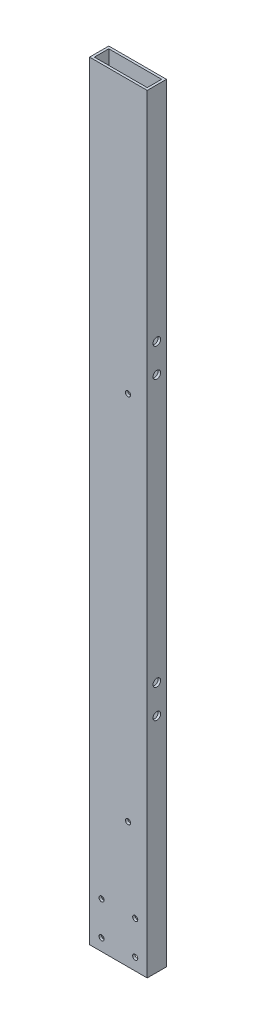
ISO-10303-21;
HEADER;
FILE_DESCRIPTION(('STEP AP214'),'2;1');
FILE_NAME('part.step','',(''),(''),'','','');
FILE_SCHEMA(('AUTOMOTIVE_DESIGN { 1 0 10303 214 1 1 1 1 }'));
ENDSEC;
DATA;
#1=APPLICATION_CONTEXT('core data for automotive mechanical design processes');
#2=APPLICATION_PROTOCOL_DEFINITION('international standard','automotive_design',2000,#1);
#3=PRODUCT_CONTEXT('',#1,'mechanical');
#4=PRODUCT('Part','Part','',(#3));
#5=PRODUCT_RELATED_PRODUCT_CATEGORY('part','',(#4));
#6=PRODUCT_DEFINITION_FORMATION('','',#4);
#7=PRODUCT_DEFINITION_CONTEXT('part definition',#1,'design');
#8=PRODUCT_DEFINITION('design','',#6,#7);
#9=PRODUCT_DEFINITION_SHAPE('','',#8);
#10=(LENGTH_UNIT() NAMED_UNIT(*) SI_UNIT(.MILLI.,.METRE.));
#11=(NAMED_UNIT(*) PLANE_ANGLE_UNIT() SI_UNIT($,.RADIAN.));
#12=(NAMED_UNIT(*) SI_UNIT($,.STERADIAN.) SOLID_ANGLE_UNIT());
#13=UNCERTAINTY_MEASURE_WITH_UNIT(LENGTH_MEASURE(1.E-05),#10,'distance_accuracy_value','');
#14=(GEOMETRIC_REPRESENTATION_CONTEXT(3) GLOBAL_UNCERTAINTY_ASSIGNED_CONTEXT((#13)) GLOBAL_UNIT_ASSIGNED_CONTEXT((#10,
#11,#12)) REPRESENTATION_CONTEXT('',''));
#15=CARTESIAN_POINT('',(0.,0.,0.));
#16=DIRECTION('',(0.,0.,1.));
#17=DIRECTION('',(1.,0.,0.));
#18=AXIS2_PLACEMENT_3D('',#15,#16,#17);
#19=CARTESIAN_POINT('',(0.,1016.,0.));
#20=DIRECTION('',(0.,-1.,0.));
#21=DIRECTION('',(0.,0.,-1.));
#22=AXIS2_PLACEMENT_3D('',#19,#20,#21);
#23=PLANE('',#22);
#24=DIRECTION('',(0.,0.,1.));
#25=VECTOR('',#24,1.);
#26=CARTESIAN_POINT('',(0.,1016.,0.));
#27=LINE('',#26,#25);
#28=CARTESIAN_POINT('',(0.,1016.,-25.4));
#29=VERTEX_POINT('',#28);
#30=CARTESIAN_POINT('',(0.,1016.,0.));
#31=VERTEX_POINT('',#30);
#32=EDGE_CURVE('E139',#29,#31,#27,.T.);
#33=ORIENTED_EDGE('',*,*,#32,.T.);
#34=DIRECTION('',(1.,0.,0.));
#35=VECTOR('',#34,1.);
#36=CARTESIAN_POINT('',(0.,1016.,0.));
#37=LINE('',#36,#35);
#38=CARTESIAN_POINT('',(76.2,1016.,0.));
#39=VERTEX_POINT('',#38);
#40=EDGE_CURVE('E142',#31,#39,#37,.T.);
#41=ORIENTED_EDGE('',*,*,#40,.T.);
#42=DIRECTION('',(0.,0.,-1.));
#43=VECTOR('',#42,1.);
#44=CARTESIAN_POINT('',(76.2,1016.,0.));
#45=LINE('',#44,#43);
#46=CARTESIAN_POINT('',(76.2,1016.,-25.4));
#47=VERTEX_POINT('',#46);
#48=EDGE_CURVE('E145',#39,#47,#45,.T.);
#49=ORIENTED_EDGE('',*,*,#48,.T.);
#50=DIRECTION('',(-1.,0.,0.));
#51=VECTOR('',#50,1.);
#52=CARTESIAN_POINT('',(0.,1016.,-25.4));
#53=LINE('',#52,#51);
#54=EDGE_CURVE('E147',#47,#29,#53,.T.);
#55=ORIENTED_EDGE('',*,*,#54,.T.);
#56=EDGE_LOOP('',(#33,#41,#49,#55));
#57=FACE_BOUND('',#56,.T.);
#58=DIRECTION('',(0.,0.,1.));
#59=VECTOR('',#58,1.);
#60=CARTESIAN_POINT('',(3.175,1016.,-3.175));
#61=LINE('',#60,#59);
#62=CARTESIAN_POINT('',(3.175,1016.,-22.225));
#63=VERTEX_POINT('',#62);
#64=CARTESIAN_POINT('',(3.175,1016.,-3.175));
#65=VERTEX_POINT('',#64);
#66=EDGE_CURVE('E101',#63,#65,#61,.T.);
#67=ORIENTED_EDGE('',*,*,#66,.F.);
#68=DIRECTION('',(-1.,0.,0.));
#69=VECTOR('',#68,1.);
#70=CARTESIAN_POINT('',(3.175,1016.,-22.225));
#71=LINE('',#70,#69);
#72=CARTESIAN_POINT('',(73.025,1016.,-22.225));
#73=VERTEX_POINT('',#72);
#74=EDGE_CURVE('E123',#73,#63,#71,.T.);
#75=ORIENTED_EDGE('',*,*,#74,.F.);
#76=DIRECTION('',(0.,0.,-1.));
#77=VECTOR('',#76,1.);
#78=CARTESIAN_POINT('',(73.025,1016.,-3.175));
#79=LINE('',#78,#77);
#80=CARTESIAN_POINT('',(73.025,1016.,-3.175));
#81=VERTEX_POINT('',#80);
#82=EDGE_CURVE('E121',#81,#73,#79,.T.);
#83=ORIENTED_EDGE('',*,*,#82,.F.);
#84=DIRECTION('',(1.,0.,0.));
#85=VECTOR('',#84,1.);
#86=CARTESIAN_POINT('',(3.175,1016.,-3.175));
#87=LINE('',#86,#85);
#88=EDGE_CURVE('E109',#65,#81,#87,.T.);
#89=ORIENTED_EDGE('',*,*,#88,.F.);
#90=EDGE_LOOP('',(#67,#75,#83,#89));
#91=FACE_BOUND('',#90,.T.);
#92=ADVANCED_FACE('F34',(#57,#91),#23,.F.);
#93=CARTESIAN_POINT('',(0.,0.,0.));
#94=DIRECTION('',(0.,-1.,0.));
#95=DIRECTION('',(0.,0.,-1.));
#96=AXIS2_PLACEMENT_3D('',#93,#94,#95);
#97=PLANE('',#96);
#98=DIRECTION('',(0.,0.,1.));
#99=VECTOR('',#98,1.);
#100=CARTESIAN_POINT('',(0.,0.,0.));
#101=LINE('',#100,#99);
#102=CARTESIAN_POINT('',(0.,0.,-25.4));
#103=VERTEX_POINT('',#102);
#104=CARTESIAN_POINT('',(0.,0.,0.));
#105=VERTEX_POINT('',#104);
#106=EDGE_CURVE('E117',#103,#105,#101,.T.);
#107=ORIENTED_EDGE('',*,*,#106,.F.);
#108=DIRECTION('',(-1.,0.,0.));
#109=VECTOR('',#108,1.);
#110=CARTESIAN_POINT('',(0.,0.,-25.4));
#111=LINE('',#110,#109);
#112=CARTESIAN_POINT('',(76.2,0.,-25.4));
#113=VERTEX_POINT('',#112);
#114=EDGE_CURVE('E143',#113,#103,#111,.T.);
#115=ORIENTED_EDGE('',*,*,#114,.F.);
#116=DIRECTION('',(0.,0.,-1.));
#117=VECTOR('',#116,1.);
#118=CARTESIAN_POINT('',(76.2,0.,0.));
#119=LINE('',#118,#117);
#120=CARTESIAN_POINT('',(76.2,0.,0.));
#121=VERTEX_POINT('',#120);
#122=EDGE_CURVE('E154',#121,#113,#119,.T.);
#123=ORIENTED_EDGE('',*,*,#122,.F.);
#124=DIRECTION('',(1.,0.,0.));
#125=VECTOR('',#124,1.);
#126=CARTESIAN_POINT('',(0.,0.,0.));
#127=LINE('',#126,#125);
#128=EDGE_CURVE('E152',#105,#121,#127,.T.);
#129=ORIENTED_EDGE('',*,*,#128,.F.);
#130=EDGE_LOOP('',(#107,#115,#123,#129));
#131=FACE_BOUND('',#130,.T.);
#132=DIRECTION('',(-1.,0.,0.));
#133=VECTOR('',#132,1.);
#134=CARTESIAN_POINT('',(3.175,0.,-22.225));
#135=LINE('',#134,#133);
#136=CARTESIAN_POINT('',(73.025,0.,-22.225));
#137=VERTEX_POINT('',#136);
#138=CARTESIAN_POINT('',(3.175,0.,-22.225));
#139=VERTEX_POINT('',#138);
#140=EDGE_CURVE('E110',#137,#139,#135,.T.);
#141=ORIENTED_EDGE('',*,*,#140,.T.);
#142=DIRECTION('',(0.,0.,1.));
#143=VECTOR('',#142,1.);
#144=CARTESIAN_POINT('',(3.175,0.,-3.175));
#145=LINE('',#144,#143);
#146=CARTESIAN_POINT('',(3.175,0.,-3.175));
#147=VERTEX_POINT('',#146);
#148=EDGE_CURVE('E59',#139,#147,#145,.T.);
#149=ORIENTED_EDGE('',*,*,#148,.T.);
#150=DIRECTION('',(1.,0.,0.));
#151=VECTOR('',#150,1.);
#152=CARTESIAN_POINT('',(3.175,0.,-3.175));
#153=LINE('',#152,#151);
#154=CARTESIAN_POINT('',(73.025,0.,-3.175));
#155=VERTEX_POINT('',#154);
#156=EDGE_CURVE('E116',#147,#155,#153,.T.);
#157=ORIENTED_EDGE('',*,*,#156,.T.);
#158=DIRECTION('',(0.,0.,-1.));
#159=VECTOR('',#158,1.);
#160=CARTESIAN_POINT('',(73.025,0.,-3.175));
#161=LINE('',#160,#159);
#162=EDGE_CURVE('E131',#155,#137,#161,.T.);
#163=ORIENTED_EDGE('',*,*,#162,.T.);
#164=EDGE_LOOP('',(#141,#149,#157,#163));
#165=FACE_BOUND('',#164,.T.);
#166=ADVANCED_FACE('F297',(#131,#165),#97,.T.);
#167=CARTESIAN_POINT('',(0.,1016.,0.));
#168=DIRECTION('',(1.,0.,0.));
#169=DIRECTION('',(0.,0.,-1.));
#170=AXIS2_PLACEMENT_3D('',#167,#168,#169);
#171=PLANE('',#170);
#172=CARTESIAN_POINT('',(0.,684.2125,-12.7));
#173=DIRECTION('',(-1.,0.,0.));
#174=DIRECTION('',(0.,0.,-1.));
#175=AXIS2_PLACEMENT_3D('',#172,#173,#174);
#176=CIRCLE('',#175,5.04189999999999);
#177=CARTESIAN_POINT('',(0.,684.2125,-17.7419));
#178=VERTEX_POINT('',#177);
#179=EDGE_CURVE('E182',#178,#178,#176,.T.);
#180=ORIENTED_EDGE('',*,*,#179,.F.);
#181=EDGE_LOOP('',(#180));
#182=FACE_BOUND('',#181,.T.);
#183=CARTESIAN_POINT('',(0.,722.3125,-12.7));
#184=DIRECTION('',(-1.,0.,0.));
#185=DIRECTION('',(0.,0.,-1.));
#186=AXIS2_PLACEMENT_3D('',#183,#184,#185);
#187=CIRCLE('',#186,5.04189999999999);
#188=CARTESIAN_POINT('',(0.,722.3125,-17.7419));
#189=VERTEX_POINT('',#188);
#190=EDGE_CURVE('E177',#189,#189,#187,.T.);
#191=ORIENTED_EDGE('',*,*,#190,.F.);
#192=EDGE_LOOP('',(#191));
#193=FACE_BOUND('',#192,.T.);
#194=CARTESIAN_POINT('',(0.,331.7875,-12.7));
#195=DIRECTION('',(1.,0.,0.));
#196=DIRECTION('',(0.,0.,-1.));
#197=AXIS2_PLACEMENT_3D('',#194,#195,#196);
#198=CIRCLE('',#197,5.04189999999999);
#199=CARTESIAN_POINT('',(0.,331.7875,-17.7419));
#200=VERTEX_POINT('',#199);
#201=EDGE_CURVE('E172',#200,#200,#198,.T.);
#202=ORIENTED_EDGE('',*,*,#201,.T.);
#203=EDGE_LOOP('',(#202));
#204=FACE_BOUND('',#203,.T.);
#205=CARTESIAN_POINT('',(0.,293.6875,-12.7));
#206=DIRECTION('',(1.,0.,0.));
#207=DIRECTION('',(0.,0.,-1.));
#208=AXIS2_PLACEMENT_3D('',#205,#206,#207);
#209=CIRCLE('',#208,5.04189999999999);
#210=CARTESIAN_POINT('',(0.,293.6875,-17.7419));
#211=VERTEX_POINT('',#210);
#212=EDGE_CURVE('E167',#211,#211,#209,.T.);
#213=ORIENTED_EDGE('',*,*,#212,.T.);
#214=EDGE_LOOP('',(#213));
#215=FACE_BOUND('',#214,.T.);
#216=ORIENTED_EDGE('',*,*,#106,.T.);
#217=DIRECTION('',(0.,-1.,0.));
#218=VECTOR('',#217,1.);
#219=CARTESIAN_POINT('',(0.,1016.,0.));
#220=LINE('',#219,#218);
#221=EDGE_CURVE('E11',#31,#105,#220,.T.);
#222=ORIENTED_EDGE('',*,*,#221,.F.);
#223=ORIENTED_EDGE('',*,*,#32,.F.);
#224=DIRECTION('',(0.,-1.,0.));
#225=VECTOR('',#224,1.);
#226=CARTESIAN_POINT('',(0.,1016.,-25.4));
#227=LINE('',#226,#225);
#228=EDGE_CURVE('E149',#29,#103,#227,.T.);
#229=ORIENTED_EDGE('',*,*,#228,.T.);
#230=EDGE_LOOP('',(#216,#222,#223,#229));
#231=FACE_BOUND('',#230,.T.);
#232=ADVANCED_FACE('F36',(#182,#193,#204,#215,#231),#171,.F.);
#233=CARTESIAN_POINT('',(0.,1016.,0.));
#234=DIRECTION('',(0.,0.,-1.));
#235=DIRECTION('',(-1.,0.,0.));
#236=AXIS2_PLACEMENT_3D('',#233,#234,#235);
#237=PLANE('',#236);
#238=CARTESIAN_POINT('',(50.8,656.031200000001,0.));
#239=DIRECTION('',(0.,0.,1.));
#240=DIRECTION('',(1.,0.,0.));
#241=AXIS2_PLACEMENT_3D('',#238,#239,#240);
#242=CIRCLE('',#241,3.37819999999997);
#243=CARTESIAN_POINT('',(54.1782,656.031200000001,0.));
#244=VERTEX_POINT('',#243);
#245=EDGE_CURVE('E317',#244,#244,#242,.T.);
#246=ORIENTED_EDGE('',*,*,#245,.F.);
#247=EDGE_LOOP('',(#246));
#248=FACE_BOUND('',#247,.T.);
#249=CARTESIAN_POINT('',(50.7999999999995,166.2938,0.));
#250=DIRECTION('',(0.,0.,1.));
#251=DIRECTION('',(1.,0.,0.));
#252=AXIS2_PLACEMENT_3D('',#249,#250,#251);
#253=CIRCLE('',#252,3.37819999999998);
#254=CARTESIAN_POINT('',(54.1781999999994,166.2938,0.));
#255=VERTEX_POINT('',#254);
#256=EDGE_CURVE('E210',#255,#255,#253,.T.);
#257=ORIENTED_EDGE('',*,*,#256,.F.);
#258=EDGE_LOOP('',(#257));
#259=FACE_BOUND('',#258,.T.);
#260=CARTESIAN_POINT('',(15.875,60.325,0.));
#261=DIRECTION('',(0.,0.,1.));
#262=DIRECTION('',(1.,0.,0.));
#263=AXIS2_PLACEMENT_3D('',#260,#261,#262);
#264=CIRCLE('',#263,3.37819999999999);
#265=CARTESIAN_POINT('',(19.2532,60.325,0.));
#266=VERTEX_POINT('',#265);
#267=EDGE_CURVE('E222',#266,#266,#264,.T.);
#268=ORIENTED_EDGE('',*,*,#267,.F.);
#269=EDGE_LOOP('',(#268));
#270=FACE_BOUND('',#269,.T.);
#271=CARTESIAN_POINT('',(60.325,15.875,0.));
#272=DIRECTION('',(0.,0.,1.));
#273=DIRECTION('',(1.,0.,0.));
#274=AXIS2_PLACEMENT_3D('',#271,#272,#273);
#275=CIRCLE('',#274,3.37820000000001);
#276=CARTESIAN_POINT('',(63.7032,15.875,0.));
#277=VERTEX_POINT('',#276);
#278=EDGE_CURVE('E228',#277,#277,#275,.T.);
#279=ORIENTED_EDGE('',*,*,#278,.F.);
#280=EDGE_LOOP('',(#279));
#281=FACE_BOUND('',#280,.T.);
#282=CARTESIAN_POINT('',(60.325,60.325,0.));
#283=DIRECTION('',(0.,0.,1.));
#284=DIRECTION('',(1.,0.,0.));
#285=AXIS2_PLACEMENT_3D('',#282,#283,#284);
#286=CIRCLE('',#285,3.37819999999999);
#287=CARTESIAN_POINT('',(63.7032,60.325,0.));
#288=VERTEX_POINT('',#287);
#289=EDGE_CURVE('E207',#288,#288,#286,.T.);
#290=ORIENTED_EDGE('',*,*,#289,.F.);
#291=EDGE_LOOP('',(#290));
#292=FACE_BOUND('',#291,.T.);
#293=CARTESIAN_POINT('',(15.875,15.875,0.));
#294=DIRECTION('',(0.,0.,1.));
#295=DIRECTION('',(1.,0.,0.));
#296=AXIS2_PLACEMENT_3D('',#293,#294,#295);
#297=CIRCLE('',#296,3.3782);
#298=CARTESIAN_POINT('',(19.2532,15.875,0.));
#299=VERTEX_POINT('',#298);
#300=EDGE_CURVE('E242',#299,#299,#297,.T.);
#301=ORIENTED_EDGE('',*,*,#300,.F.);
#302=EDGE_LOOP('',(#301));
#303=FACE_BOUND('',#302,.T.);
#304=ORIENTED_EDGE('',*,*,#128,.T.);
#305=DIRECTION('',(0.,-1.,0.));
#306=VECTOR('',#305,1.);
#307=CARTESIAN_POINT('',(76.2,1016.,0.));
#308=LINE('',#307,#306);
#309=EDGE_CURVE('E43',#39,#121,#308,.T.);
#310=ORIENTED_EDGE('',*,*,#309,.F.);
#311=ORIENTED_EDGE('',*,*,#40,.F.);
#312=ORIENTED_EDGE('',*,*,#221,.T.);
#313=EDGE_LOOP('',(#304,#310,#311,#312));
#314=FACE_BOUND('',#313,.T.);
#315=ADVANCED_FACE('F306',(#248,#259,#270,#281,#292,#303,#314),#237,.F.);
#316=CARTESIAN_POINT('',(76.2,1016.,0.));
#317=DIRECTION('',(-1.,0.,0.));
#318=DIRECTION('',(0.,0.,1.));
#319=AXIS2_PLACEMENT_3D('',#316,#317,#318);
#320=PLANE('',#319);
#321=CARTESIAN_POINT('',(76.2,684.2125,-12.7));
#322=DIRECTION('',(-1.,0.,0.));
#323=DIRECTION('',(0.,0.,-1.));
#324=AXIS2_PLACEMENT_3D('',#321,#322,#323);
#325=CIRCLE('',#324,5.04189999999999);
#326=CARTESIAN_POINT('',(76.2,684.2125,-17.7419));
#327=VERTEX_POINT('',#326);
#328=EDGE_CURVE('E249',#327,#327,#325,.T.);
#329=ORIENTED_EDGE('',*,*,#328,.T.);
#330=EDGE_LOOP('',(#329));
#331=FACE_BOUND('',#330,.T.);
#332=CARTESIAN_POINT('',(76.2,722.3125,-12.7));
#333=DIRECTION('',(-1.,0.,0.));
#334=DIRECTION('',(0.,0.,-1.));
#335=AXIS2_PLACEMENT_3D('',#332,#333,#334);
#336=CIRCLE('',#335,5.04189999999999);
#337=CARTESIAN_POINT('',(76.2,722.3125,-17.7419));
#338=VERTEX_POINT('',#337);
#339=EDGE_CURVE('E256',#338,#338,#336,.T.);
#340=ORIENTED_EDGE('',*,*,#339,.T.);
#341=EDGE_LOOP('',(#340));
#342=FACE_BOUND('',#341,.T.);
#343=CARTESIAN_POINT('',(76.2,331.7875,-12.7));
#344=DIRECTION('',(1.,0.,0.));
#345=DIRECTION('',(0.,0.,-1.));
#346=AXIS2_PLACEMENT_3D('',#343,#344,#345);
#347=CIRCLE('',#346,5.04189999999999);
#348=CARTESIAN_POINT('',(76.2,331.7875,-17.7419));
#349=VERTEX_POINT('',#348);
#350=EDGE_CURVE('E263',#349,#349,#347,.T.);
#351=ORIENTED_EDGE('',*,*,#350,.F.);
#352=EDGE_LOOP('',(#351));
#353=FACE_BOUND('',#352,.T.);
#354=CARTESIAN_POINT('',(76.2,293.6875,-12.7));
#355=DIRECTION('',(1.,0.,0.));
#356=DIRECTION('',(0.,0.,-1.));
#357=AXIS2_PLACEMENT_3D('',#354,#355,#356);
#358=CIRCLE('',#357,5.04189999999999);
#359=CARTESIAN_POINT('',(76.2,293.6875,-17.7419));
#360=VERTEX_POINT('',#359);
#361=EDGE_CURVE('E270',#360,#360,#358,.T.);
#362=ORIENTED_EDGE('',*,*,#361,.F.);
#363=EDGE_LOOP('',(#362));
#364=FACE_BOUND('',#363,.T.);
#365=ORIENTED_EDGE('',*,*,#122,.T.);
#366=DIRECTION('',(0.,-1.,0.));
#367=VECTOR('',#366,1.);
#368=CARTESIAN_POINT('',(76.2,1016.,-25.4));
#369=LINE('',#368,#367);
#370=EDGE_CURVE('E159',#47,#113,#369,.T.);
#371=ORIENTED_EDGE('',*,*,#370,.F.);
#372=ORIENTED_EDGE('',*,*,#48,.F.);
#373=ORIENTED_EDGE('',*,*,#309,.T.);
#374=EDGE_LOOP('',(#365,#371,#372,#373));
#375=FACE_BOUND('',#374,.T.);
#376=ADVANCED_FACE('F291',(#331,#342,#353,#364,#375),#320,.F.);
#377=CARTESIAN_POINT('',(0.,1016.,-25.4));
#378=DIRECTION('',(0.,0.,1.));
#379=DIRECTION('',(1.,0.,0.));
#380=AXIS2_PLACEMENT_3D('',#377,#378,#379);
#381=PLANE('',#380);
#382=CARTESIAN_POINT('',(50.8,656.031200000001,-25.4));
#383=DIRECTION('',(0.,0.,1.));
#384=DIRECTION('',(1.,0.,0.));
#385=AXIS2_PLACEMENT_3D('',#382,#383,#384);
#386=CIRCLE('',#385,3.37819999999997);
#387=CARTESIAN_POINT('',(54.1782,656.031200000001,-25.4));
#388=VERTEX_POINT('',#387);
#389=EDGE_CURVE('E412',#388,#388,#386,.T.);
#390=ORIENTED_EDGE('',*,*,#389,.T.);
#391=EDGE_LOOP('',(#390));
#392=FACE_BOUND('',#391,.T.);
#393=CARTESIAN_POINT('',(50.7999999999995,166.2938,-25.4));
#394=DIRECTION('',(0.,0.,1.));
#395=DIRECTION('',(1.,0.,0.));
#396=AXIS2_PLACEMENT_3D('',#393,#394,#395);
#397=CIRCLE('',#396,3.37819999999998);
#398=CARTESIAN_POINT('',(54.1781999999994,166.2938,-25.4));
#399=VERTEX_POINT('',#398);
#400=EDGE_CURVE('E203',#399,#399,#397,.T.);
#401=ORIENTED_EDGE('',*,*,#400,.T.);
#402=EDGE_LOOP('',(#401));
#403=FACE_BOUND('',#402,.T.);
#404=CARTESIAN_POINT('',(15.875,60.325,-25.4));
#405=DIRECTION('',(0.,0.,1.));
#406=DIRECTION('',(1.,0.,0.));
#407=AXIS2_PLACEMENT_3D('',#404,#405,#406);
#408=CIRCLE('',#407,3.37819999999999);
#409=CARTESIAN_POINT('',(19.2532,60.325,-25.4));
#410=VERTEX_POINT('',#409);
#411=EDGE_CURVE('E192',#410,#410,#408,.T.);
#412=ORIENTED_EDGE('',*,*,#411,.T.);
#413=EDGE_LOOP('',(#412));
#414=FACE_BOUND('',#413,.T.);
#415=CARTESIAN_POINT('',(60.325,15.875,-25.4));
#416=DIRECTION('',(0.,0.,1.));
#417=DIRECTION('',(1.,0.,0.));
#418=AXIS2_PLACEMENT_3D('',#415,#416,#417);
#419=CIRCLE('',#418,3.37820000000001);
#420=CARTESIAN_POINT('',(63.7032,15.875,-25.4));
#421=VERTEX_POINT('',#420);
#422=EDGE_CURVE('E225',#421,#421,#419,.T.);
#423=ORIENTED_EDGE('',*,*,#422,.T.);
#424=EDGE_LOOP('',(#423));
#425=FACE_BOUND('',#424,.T.);
#426=CARTESIAN_POINT('',(60.325,60.325,-25.4));
#427=DIRECTION('',(0.,0.,1.));
#428=DIRECTION('',(1.,0.,0.));
#429=AXIS2_PLACEMENT_3D('',#426,#427,#428);
#430=CIRCLE('',#429,3.37819999999999);
#431=CARTESIAN_POINT('',(63.7032,60.325,-25.4));
#432=VERTEX_POINT('',#431);
#433=EDGE_CURVE('E231',#432,#432,#430,.T.);
#434=ORIENTED_EDGE('',*,*,#433,.T.);
#435=EDGE_LOOP('',(#434));
#436=FACE_BOUND('',#435,.T.);
#437=CARTESIAN_POINT('',(15.875,15.875,-25.4));
#438=DIRECTION('',(0.,0.,1.));
#439=DIRECTION('',(1.,0.,0.));
#440=AXIS2_PLACEMENT_3D('',#437,#438,#439);
#441=CIRCLE('',#440,3.3782);
#442=CARTESIAN_POINT('',(19.2532,15.875,-25.4));
#443=VERTEX_POINT('',#442);
#444=EDGE_CURVE('E187',#443,#443,#441,.T.);
#445=ORIENTED_EDGE('',*,*,#444,.T.);
#446=EDGE_LOOP('',(#445));
#447=FACE_BOUND('',#446,.T.);
#448=ORIENTED_EDGE('',*,*,#114,.T.);
#449=ORIENTED_EDGE('',*,*,#228,.F.);
#450=ORIENTED_EDGE('',*,*,#54,.F.);
#451=ORIENTED_EDGE('',*,*,#370,.T.);
#452=EDGE_LOOP('',(#448,#449,#450,#451));
#453=FACE_BOUND('',#452,.T.);
#454=ADVANCED_FACE('F281',(#392,#403,#414,#425,#436,#447,#453),#381,.F.);
#455=CARTESIAN_POINT('',(3.175,1016.,-3.175));
#456=DIRECTION('',(1.,0.,0.));
#457=DIRECTION('',(0.,0.,-1.));
#458=AXIS2_PLACEMENT_3D('',#455,#456,#457);
#459=PLANE('',#458);
#460=CARTESIAN_POINT('',(3.175,684.2125,-12.7));
#461=DIRECTION('',(1.,0.,0.));
#462=DIRECTION('',(0.,0.,-1.));
#463=AXIS2_PLACEMENT_3D('',#460,#461,#462);
#464=CIRCLE('',#463,5.04189999999999);
#465=CARTESIAN_POINT('',(3.175,684.2125,-17.7419));
#466=VERTEX_POINT('',#465);
#467=EDGE_CURVE('E181',#466,#466,#464,.F.);
#468=ORIENTED_EDGE('',*,*,#467,.T.);
#469=EDGE_LOOP('',(#468));
#470=FACE_BOUND('',#469,.T.);
#471=CARTESIAN_POINT('',(3.175,722.3125,-12.7));
#472=DIRECTION('',(1.,0.,0.));
#473=DIRECTION('',(0.,0.,-1.));
#474=AXIS2_PLACEMENT_3D('',#471,#472,#473);
#475=CIRCLE('',#474,5.04189999999999);
#476=CARTESIAN_POINT('',(3.175,722.3125,-17.7419));
#477=VERTEX_POINT('',#476);
#478=EDGE_CURVE('E176',#477,#477,#475,.F.);
#479=ORIENTED_EDGE('',*,*,#478,.T.);
#480=EDGE_LOOP('',(#479));
#481=FACE_BOUND('',#480,.T.);
#482=CARTESIAN_POINT('',(3.175,331.7875,-12.7));
#483=DIRECTION('',(1.,0.,0.));
#484=DIRECTION('',(0.,0.,-1.));
#485=AXIS2_PLACEMENT_3D('',#482,#483,#484);
#486=CIRCLE('',#485,5.04189999999999);
#487=CARTESIAN_POINT('',(3.175,331.7875,-17.7419));
#488=VERTEX_POINT('',#487);
#489=EDGE_CURVE('E171',#488,#488,#486,.T.);
#490=ORIENTED_EDGE('',*,*,#489,.F.);
#491=EDGE_LOOP('',(#490));
#492=FACE_BOUND('',#491,.T.);
#493=CARTESIAN_POINT('',(3.175,293.6875,-12.7));
#494=DIRECTION('',(1.,0.,0.));
#495=DIRECTION('',(0.,0.,-1.));
#496=AXIS2_PLACEMENT_3D('',#493,#494,#495);
#497=CIRCLE('',#496,5.04189999999999);
#498=CARTESIAN_POINT('',(3.175,293.6875,-17.7419));
#499=VERTEX_POINT('',#498);
#500=EDGE_CURVE('E129',#499,#499,#497,.T.);
#501=ORIENTED_EDGE('',*,*,#500,.F.);
#502=EDGE_LOOP('',(#501));
#503=FACE_BOUND('',#502,.T.);
#504=ORIENTED_EDGE('',*,*,#148,.F.);
#505=DIRECTION('',(0.,-1.,0.));
#506=VECTOR('',#505,1.);
#507=CARTESIAN_POINT('',(3.175,1016.,-22.225));
#508=LINE('',#507,#506);
#509=EDGE_CURVE('E105',#63,#139,#508,.T.);
#510=ORIENTED_EDGE('',*,*,#509,.F.);
#511=ORIENTED_EDGE('',*,*,#66,.T.);
#512=DIRECTION('',(0.,-1.,0.));
#513=VECTOR('',#512,1.);
#514=CARTESIAN_POINT('',(3.175,1016.,-3.175));
#515=LINE('',#514,#513);
#516=EDGE_CURVE('E104',#65,#147,#515,.T.);
#517=ORIENTED_EDGE('',*,*,#516,.T.);
#518=EDGE_LOOP('',(#504,#510,#511,#517));
#519=FACE_BOUND('',#518,.T.);
#520=ADVANCED_FACE('F103',(#470,#481,#492,#503,#519),#459,.T.);
#521=CARTESIAN_POINT('',(3.175,1016.,-3.175));
#522=DIRECTION('',(0.,0.,-1.));
#523=DIRECTION('',(-1.,0.,0.));
#524=AXIS2_PLACEMENT_3D('',#521,#522,#523);
#525=PLANE('',#524);
#526=CARTESIAN_POINT('',(50.8,656.031200000001,-3.175));
#527=DIRECTION('',(0.,0.,-1.));
#528=DIRECTION('',(-1.,0.,0.));
#529=AXIS2_PLACEMENT_3D('',#526,#527,#528);
#530=CIRCLE('',#529,3.37819999999997);
#531=CARTESIAN_POINT('',(47.4218000000001,656.031200000001,-3.175));
#532=VERTEX_POINT('',#531);
#533=EDGE_CURVE('E215',#532,#532,#530,.T.);
#534=ORIENTED_EDGE('',*,*,#533,.F.);
#535=EDGE_LOOP('',(#534));
#536=FACE_BOUND('',#535,.T.);
#537=CARTESIAN_POINT('',(50.7999999999995,166.2938,-3.175));
#538=DIRECTION('',(0.,0.,-1.));
#539=DIRECTION('',(-1.,0.,0.));
#540=AXIS2_PLACEMENT_3D('',#537,#538,#539);
#541=CIRCLE('',#540,3.37819999999998);
#542=CARTESIAN_POINT('',(47.4217999999995,166.2938,-3.175));
#543=VERTEX_POINT('',#542);
#544=EDGE_CURVE('E202',#543,#543,#541,.T.);
#545=ORIENTED_EDGE('',*,*,#544,.F.);
#546=EDGE_LOOP('',(#545));
#547=FACE_BOUND('',#546,.T.);
#548=CARTESIAN_POINT('',(15.875,60.325,-3.175));
#549=DIRECTION('',(0.,0.,-1.));
#550=DIRECTION('',(-1.,0.,0.));
#551=AXIS2_PLACEMENT_3D('',#548,#549,#550);
#552=CIRCLE('',#551,3.37819999999999);
#553=CARTESIAN_POINT('',(12.4968,60.325,-3.175));
#554=VERTEX_POINT('',#553);
#555=EDGE_CURVE('E199',#554,#554,#552,.T.);
#556=ORIENTED_EDGE('',*,*,#555,.F.);
#557=EDGE_LOOP('',(#556));
#558=FACE_BOUND('',#557,.T.);
#559=CARTESIAN_POINT('',(60.325,15.875,-3.175));
#560=DIRECTION('',(0.,0.,-1.));
#561=DIRECTION('',(-1.,0.,0.));
#562=AXIS2_PLACEMENT_3D('',#559,#560,#561);
#563=CIRCLE('',#562,3.37820000000001);
#564=CARTESIAN_POINT('',(56.9468,15.875,-3.175));
#565=VERTEX_POINT('',#564);
#566=EDGE_CURVE('E196',#565,#565,#563,.T.);
#567=ORIENTED_EDGE('',*,*,#566,.F.);
#568=EDGE_LOOP('',(#567));
#569=FACE_BOUND('',#568,.T.);
#570=CARTESIAN_POINT('',(60.325,60.325,-3.175));
#571=DIRECTION('',(0.,0.,-1.));
#572=DIRECTION('',(-1.,0.,0.));
#573=AXIS2_PLACEMENT_3D('',#570,#571,#572);
#574=CIRCLE('',#573,3.37819999999999);
#575=CARTESIAN_POINT('',(56.9468,60.325,-3.175));
#576=VERTEX_POINT('',#575);
#577=EDGE_CURVE('E191',#576,#576,#574,.T.);
#578=ORIENTED_EDGE('',*,*,#577,.F.);
#579=EDGE_LOOP('',(#578));
#580=FACE_BOUND('',#579,.T.);
#581=CARTESIAN_POINT('',(15.875,15.875,-3.175));
#582=DIRECTION('',(0.,0.,-1.));
#583=DIRECTION('',(-1.,0.,0.));
#584=AXIS2_PLACEMENT_3D('',#581,#582,#583);
#585=CIRCLE('',#584,3.3782);
#586=CARTESIAN_POINT('',(12.4968,15.875,-3.175));
#587=VERTEX_POINT('',#586);
#588=EDGE_CURVE('E186',#587,#587,#585,.T.);
#589=ORIENTED_EDGE('',*,*,#588,.F.);
#590=EDGE_LOOP('',(#589));
#591=FACE_BOUND('',#590,.T.);
#592=ORIENTED_EDGE('',*,*,#156,.F.);
#593=ORIENTED_EDGE('',*,*,#516,.F.);
#594=ORIENTED_EDGE('',*,*,#88,.T.);
#595=DIRECTION('',(0.,-1.,0.));
#596=VECTOR('',#595,1.);
#597=CARTESIAN_POINT('',(73.025,1016.,-3.175));
#598=LINE('',#597,#596);
#599=EDGE_CURVE('E118',#81,#155,#598,.T.);
#600=ORIENTED_EDGE('',*,*,#599,.T.);
#601=EDGE_LOOP('',(#592,#593,#594,#600));
#602=FACE_BOUND('',#601,.T.);
#603=ADVANCED_FACE('F113',(#536,#547,#558,#569,#580,#591,#602),#525,.T.);
#604=CARTESIAN_POINT('',(73.025,1016.,-3.175));
#605=DIRECTION('',(-1.,0.,0.));
#606=DIRECTION('',(0.,0.,1.));
#607=AXIS2_PLACEMENT_3D('',#604,#605,#606);
#608=PLANE('',#607);
#609=CARTESIAN_POINT('',(73.025,684.2125,-12.7));
#610=DIRECTION('',(-1.,0.,0.));
#611=DIRECTION('',(0.,0.,1.));
#612=AXIS2_PLACEMENT_3D('',#609,#610,#611);
#613=CIRCLE('',#612,5.04189999999999);
#614=CARTESIAN_POINT('',(73.025,684.2125,-7.65810000000001));
#615=VERTEX_POINT('',#614);
#616=EDGE_CURVE('E178',#615,#615,#613,.F.);
#617=ORIENTED_EDGE('',*,*,#616,.T.);
#618=EDGE_LOOP('',(#617));
#619=FACE_BOUND('',#618,.T.);
#620=CARTESIAN_POINT('',(73.025,722.3125,-12.7));
#621=DIRECTION('',(-1.,0.,0.));
#622=DIRECTION('',(0.,0.,1.));
#623=AXIS2_PLACEMENT_3D('',#620,#621,#622);
#624=CIRCLE('',#623,5.04189999999999);
#625=CARTESIAN_POINT('',(73.025,722.3125,-7.6581));
#626=VERTEX_POINT('',#625);
#627=EDGE_CURVE('E173',#626,#626,#624,.F.);
#628=ORIENTED_EDGE('',*,*,#627,.T.);
#629=EDGE_LOOP('',(#628));
#630=FACE_BOUND('',#629,.T.);
#631=CARTESIAN_POINT('',(73.025,331.7875,-12.7));
#632=DIRECTION('',(-1.,0.,0.));
#633=DIRECTION('',(0.,0.,1.));
#634=AXIS2_PLACEMENT_3D('',#631,#632,#633);
#635=CIRCLE('',#634,5.04189999999999);
#636=CARTESIAN_POINT('',(73.025,331.7875,-7.65810000000001));
#637=VERTEX_POINT('',#636);
#638=EDGE_CURVE('E168',#637,#637,#635,.T.);
#639=ORIENTED_EDGE('',*,*,#638,.F.);
#640=EDGE_LOOP('',(#639));
#641=FACE_BOUND('',#640,.T.);
#642=CARTESIAN_POINT('',(73.025,293.6875,-12.7));
#643=DIRECTION('',(-1.,0.,0.));
#644=DIRECTION('',(0.,0.,1.));
#645=AXIS2_PLACEMENT_3D('',#642,#643,#644);
#646=CIRCLE('',#645,5.04189999999999);
#647=CARTESIAN_POINT('',(73.025,293.6875,-7.6581));
#648=VERTEX_POINT('',#647);
#649=EDGE_CURVE('E164',#648,#648,#646,.T.);
#650=ORIENTED_EDGE('',*,*,#649,.F.);
#651=EDGE_LOOP('',(#650));
#652=FACE_BOUND('',#651,.T.);
#653=ORIENTED_EDGE('',*,*,#162,.F.);
#654=ORIENTED_EDGE('',*,*,#599,.F.);
#655=ORIENTED_EDGE('',*,*,#82,.T.);
#656=DIRECTION('',(0.,-1.,0.));
#657=VECTOR('',#656,1.);
#658=CARTESIAN_POINT('',(73.025,1016.,-22.225));
#659=LINE('',#658,#657);
#660=EDGE_CURVE('E51',#73,#137,#659,.T.);
#661=ORIENTED_EDGE('',*,*,#660,.T.);
#662=EDGE_LOOP('',(#653,#654,#655,#661));
#663=FACE_BOUND('',#662,.T.);
#664=ADVANCED_FACE('F288',(#619,#630,#641,#652,#663),#608,.T.);
#665=CARTESIAN_POINT('',(3.175,1016.,-22.225));
#666=DIRECTION('',(0.,0.,1.));
#667=DIRECTION('',(1.,0.,0.));
#668=AXIS2_PLACEMENT_3D('',#665,#666,#667);
#669=PLANE('',#668);
#670=CARTESIAN_POINT('',(50.8,656.031200000001,-22.225));
#671=DIRECTION('',(0.,0.,1.));
#672=DIRECTION('',(1.,0.,0.));
#673=AXIS2_PLACEMENT_3D('',#670,#671,#672);
#674=CIRCLE('',#673,3.37819999999997);
#675=CARTESIAN_POINT('',(54.1782,656.031200000001,-22.225));
#676=VERTEX_POINT('',#675);
#677=EDGE_CURVE('E38',#676,#676,#674,.T.);
#678=ORIENTED_EDGE('',*,*,#677,.F.);
#679=EDGE_LOOP('',(#678));
#680=FACE_BOUND('',#679,.T.);
#681=CARTESIAN_POINT('',(50.7999999999995,166.2938,-22.225));
#682=DIRECTION('',(0.,0.,1.));
#683=DIRECTION('',(1.,0.,0.));
#684=AXIS2_PLACEMENT_3D('',#681,#682,#683);
#685=CIRCLE('',#684,3.37819999999998);
#686=CARTESIAN_POINT('',(54.1781999999994,166.2938,-22.225));
#687=VERTEX_POINT('',#686);
#688=EDGE_CURVE('E200',#687,#687,#685,.T.);
#689=ORIENTED_EDGE('',*,*,#688,.F.);
#690=EDGE_LOOP('',(#689));
#691=FACE_BOUND('',#690,.T.);
#692=CARTESIAN_POINT('',(15.875,60.325,-22.225));
#693=DIRECTION('',(0.,0.,1.));
#694=DIRECTION('',(1.,0.,0.));
#695=AXIS2_PLACEMENT_3D('',#692,#693,#694);
#696=CIRCLE('',#695,3.37819999999999);
#697=CARTESIAN_POINT('',(19.2532,60.325,-22.225));
#698=VERTEX_POINT('',#697);
#699=EDGE_CURVE('E197',#698,#698,#696,.T.);
#700=ORIENTED_EDGE('',*,*,#699,.F.);
#701=EDGE_LOOP('',(#700));
#702=FACE_BOUND('',#701,.T.);
#703=CARTESIAN_POINT('',(60.325,15.875,-22.225));
#704=DIRECTION('',(0.,0.,1.));
#705=DIRECTION('',(1.,0.,0.));
#706=AXIS2_PLACEMENT_3D('',#703,#704,#705);
#707=CIRCLE('',#706,3.37820000000001);
#708=CARTESIAN_POINT('',(63.7032,15.875,-22.225));
#709=VERTEX_POINT('',#708);
#710=EDGE_CURVE('E193',#709,#709,#707,.T.);
#711=ORIENTED_EDGE('',*,*,#710,.F.);
#712=EDGE_LOOP('',(#711));
#713=FACE_BOUND('',#712,.T.);
#714=CARTESIAN_POINT('',(60.325,60.325,-22.225));
#715=DIRECTION('',(0.,0.,1.));
#716=DIRECTION('',(1.,0.,0.));
#717=AXIS2_PLACEMENT_3D('',#714,#715,#716);
#718=CIRCLE('',#717,3.37819999999999);
#719=CARTESIAN_POINT('',(63.7032,60.325,-22.225));
#720=VERTEX_POINT('',#719);
#721=EDGE_CURVE('E188',#720,#720,#718,.T.);
#722=ORIENTED_EDGE('',*,*,#721,.F.);
#723=EDGE_LOOP('',(#722));
#724=FACE_BOUND('',#723,.T.);
#725=CARTESIAN_POINT('',(15.875,15.875,-22.225));
#726=DIRECTION('',(0.,0.,1.));
#727=DIRECTION('',(1.,0.,0.));
#728=AXIS2_PLACEMENT_3D('',#725,#726,#727);
#729=CIRCLE('',#728,3.3782);
#730=CARTESIAN_POINT('',(19.2532,15.875,-22.225));
#731=VERTEX_POINT('',#730);
#732=EDGE_CURVE('E183',#731,#731,#729,.T.);
#733=ORIENTED_EDGE('',*,*,#732,.F.);
#734=EDGE_LOOP('',(#733));
#735=FACE_BOUND('',#734,.T.);
#736=ORIENTED_EDGE('',*,*,#140,.F.);
#737=ORIENTED_EDGE('',*,*,#660,.F.);
#738=ORIENTED_EDGE('',*,*,#74,.T.);
#739=ORIENTED_EDGE('',*,*,#509,.T.);
#740=EDGE_LOOP('',(#736,#737,#738,#739));
#741=FACE_BOUND('',#740,.T.);
#742=ADVANCED_FACE('F343',(#680,#691,#702,#713,#724,#735,#741),#669,.T.);
#743=CARTESIAN_POINT('',(0.,293.6875,-12.7));
#744=DIRECTION('',(1.,0.,0.));
#745=DIRECTION('',(0.,0.,-1.));
#746=AXIS2_PLACEMENT_3D('',#743,#744,#745);
#747=CYLINDRICAL_SURFACE('',#746,5.04189999999999);
#748=ORIENTED_EDGE('',*,*,#649,.T.);
#749=EDGE_LOOP('',(#748));
#750=FACE_BOUND('',#749,.T.);
#751=ORIENTED_EDGE('',*,*,#361,.T.);
#752=EDGE_LOOP('',(#751));
#753=FACE_BOUND('',#752,.T.);
#754=ADVANCED_FACE('F345',(#750,#753),#747,.F.);
#755=ORIENTED_EDGE('',*,*,#500,.T.);
#756=EDGE_LOOP('',(#755));
#757=FACE_BOUND('',#756,.T.);
#758=ORIENTED_EDGE('',*,*,#212,.F.);
#759=EDGE_LOOP('',(#758));
#760=FACE_BOUND('',#759,.T.);
#761=ADVANCED_FACE('F277',(#757,#760),#747,.F.);
#762=CARTESIAN_POINT('',(0.,331.7875,-12.7));
#763=DIRECTION('',(1.,0.,0.));
#764=DIRECTION('',(0.,0.,-1.));
#765=AXIS2_PLACEMENT_3D('',#762,#763,#764);
#766=CYLINDRICAL_SURFACE('',#765,5.04189999999999);
#767=ORIENTED_EDGE('',*,*,#638,.T.);
#768=EDGE_LOOP('',(#767));
#769=FACE_BOUND('',#768,.T.);
#770=ORIENTED_EDGE('',*,*,#350,.T.);
#771=EDGE_LOOP('',(#770));
#772=FACE_BOUND('',#771,.T.);
#773=ADVANCED_FACE('F359',(#769,#772),#766,.F.);
#774=ORIENTED_EDGE('',*,*,#489,.T.);
#775=EDGE_LOOP('',(#774));
#776=FACE_BOUND('',#775,.T.);
#777=ORIENTED_EDGE('',*,*,#201,.F.);
#778=EDGE_LOOP('',(#777));
#779=FACE_BOUND('',#778,.T.);
#780=ADVANCED_FACE('F362',(#776,#779),#766,.F.);
#781=CARTESIAN_POINT('',(0.,722.3125,-12.7));
#782=DIRECTION('',(1.,0.,0.));
#783=DIRECTION('',(0.,0.,-1.));
#784=AXIS2_PLACEMENT_3D('',#781,#782,#783);
#785=CYLINDRICAL_SURFACE('',#784,5.04189999999999);
#786=ORIENTED_EDGE('',*,*,#627,.F.);
#787=EDGE_LOOP('',(#786));
#788=FACE_BOUND('',#787,.T.);
#789=ORIENTED_EDGE('',*,*,#339,.F.);
#790=EDGE_LOOP('',(#789));
#791=FACE_BOUND('',#790,.T.);
#792=ADVANCED_FACE('F364',(#788,#791),#785,.F.);
#793=ORIENTED_EDGE('',*,*,#478,.F.);
#794=EDGE_LOOP('',(#793));
#795=FACE_BOUND('',#794,.T.);
#796=ORIENTED_EDGE('',*,*,#190,.T.);
#797=EDGE_LOOP('',(#796));
#798=FACE_BOUND('',#797,.T.);
#799=ADVANCED_FACE('F367',(#795,#798),#785,.F.);
#800=CARTESIAN_POINT('',(0.,684.2125,-12.7));
#801=DIRECTION('',(1.,0.,0.));
#802=DIRECTION('',(0.,0.,-1.));
#803=AXIS2_PLACEMENT_3D('',#800,#801,#802);
#804=CYLINDRICAL_SURFACE('',#803,5.04189999999999);
#805=ORIENTED_EDGE('',*,*,#616,.F.);
#806=EDGE_LOOP('',(#805));
#807=FACE_BOUND('',#806,.T.);
#808=ORIENTED_EDGE('',*,*,#328,.F.);
#809=EDGE_LOOP('',(#808));
#810=FACE_BOUND('',#809,.T.);
#811=ADVANCED_FACE('F369',(#807,#810),#804,.F.);
#812=ORIENTED_EDGE('',*,*,#467,.F.);
#813=EDGE_LOOP('',(#812));
#814=FACE_BOUND('',#813,.T.);
#815=ORIENTED_EDGE('',*,*,#179,.T.);
#816=EDGE_LOOP('',(#815));
#817=FACE_BOUND('',#816,.T.);
#818=ADVANCED_FACE('F372',(#814,#817),#804,.F.);
#819=CARTESIAN_POINT('',(15.875,15.875,-25.4));
#820=DIRECTION('',(0.,0.,1.));
#821=DIRECTION('',(1.,0.,0.));
#822=AXIS2_PLACEMENT_3D('',#819,#820,#821);
#823=CYLINDRICAL_SURFACE('',#822,3.3782);
#824=ORIENTED_EDGE('',*,*,#732,.T.);
#825=EDGE_LOOP('',(#824));
#826=FACE_BOUND('',#825,.T.);
#827=ORIENTED_EDGE('',*,*,#444,.F.);
#828=EDGE_LOOP('',(#827));
#829=FACE_BOUND('',#828,.T.);
#830=ADVANCED_FACE('F374',(#826,#829),#823,.F.);
#831=ORIENTED_EDGE('',*,*,#588,.T.);
#832=EDGE_LOOP('',(#831));
#833=FACE_BOUND('',#832,.T.);
#834=ORIENTED_EDGE('',*,*,#300,.T.);
#835=EDGE_LOOP('',(#834));
#836=FACE_BOUND('',#835,.T.);
#837=ADVANCED_FACE('F377',(#833,#836),#823,.F.);
#838=CARTESIAN_POINT('',(60.325,60.325,-25.4));
#839=DIRECTION('',(0.,0.,1.));
#840=DIRECTION('',(1.,0.,0.));
#841=AXIS2_PLACEMENT_3D('',#838,#839,#840);
#842=CYLINDRICAL_SURFACE('',#841,3.37819999999999);
#843=ORIENTED_EDGE('',*,*,#721,.T.);
#844=EDGE_LOOP('',(#843));
#845=FACE_BOUND('',#844,.T.);
#846=ORIENTED_EDGE('',*,*,#433,.F.);
#847=EDGE_LOOP('',(#846));
#848=FACE_BOUND('',#847,.T.);
#849=ADVANCED_FACE('F379',(#845,#848),#842,.F.);
#850=CARTESIAN_POINT('',(60.325,15.875,-25.4));
#851=DIRECTION('',(0.,0.,1.));
#852=DIRECTION('',(1.,0.,0.));
#853=AXIS2_PLACEMENT_3D('',#850,#851,#852);
#854=CYLINDRICAL_SURFACE('',#853,3.37820000000001);
#855=ORIENTED_EDGE('',*,*,#710,.T.);
#856=EDGE_LOOP('',(#855));
#857=FACE_BOUND('',#856,.T.);
#858=ORIENTED_EDGE('',*,*,#422,.F.);
#859=EDGE_LOOP('',(#858));
#860=FACE_BOUND('',#859,.T.);
#861=ADVANCED_FACE('F382',(#857,#860),#854,.F.);
#862=CARTESIAN_POINT('',(15.875,60.325,-25.4));
#863=DIRECTION('',(0.,0.,1.));
#864=DIRECTION('',(1.,0.,0.));
#865=AXIS2_PLACEMENT_3D('',#862,#863,#864);
#866=CYLINDRICAL_SURFACE('',#865,3.37819999999999);
#867=ORIENTED_EDGE('',*,*,#699,.T.);
#868=EDGE_LOOP('',(#867));
#869=FACE_BOUND('',#868,.T.);
#870=ORIENTED_EDGE('',*,*,#411,.F.);
#871=EDGE_LOOP('',(#870));
#872=FACE_BOUND('',#871,.T.);
#873=ADVANCED_FACE('F387',(#869,#872),#866,.F.);
#874=ORIENTED_EDGE('',*,*,#577,.T.);
#875=EDGE_LOOP('',(#874));
#876=FACE_BOUND('',#875,.T.);
#877=ORIENTED_EDGE('',*,*,#289,.T.);
#878=EDGE_LOOP('',(#877));
#879=FACE_BOUND('',#878,.T.);
#880=ADVANCED_FACE('F384',(#876,#879),#842,.F.);
#881=ORIENTED_EDGE('',*,*,#566,.T.);
#882=EDGE_LOOP('',(#881));
#883=FACE_BOUND('',#882,.T.);
#884=ORIENTED_EDGE('',*,*,#278,.T.);
#885=EDGE_LOOP('',(#884));
#886=FACE_BOUND('',#885,.T.);
#887=ADVANCED_FACE('F389',(#883,#886),#854,.F.);
#888=ORIENTED_EDGE('',*,*,#555,.T.);
#889=EDGE_LOOP('',(#888));
#890=FACE_BOUND('',#889,.T.);
#891=ORIENTED_EDGE('',*,*,#267,.T.);
#892=EDGE_LOOP('',(#891));
#893=FACE_BOUND('',#892,.T.);
#894=ADVANCED_FACE('F393',(#890,#893),#866,.F.);
#895=CARTESIAN_POINT('',(50.7999999999995,166.2938,-25.4));
#896=DIRECTION('',(0.,0.,1.));
#897=DIRECTION('',(1.,0.,0.));
#898=AXIS2_PLACEMENT_3D('',#895,#896,#897);
#899=CYLINDRICAL_SURFACE('',#898,3.37819999999998);
#900=ORIENTED_EDGE('',*,*,#688,.T.);
#901=EDGE_LOOP('',(#900));
#902=FACE_BOUND('',#901,.T.);
#903=ORIENTED_EDGE('',*,*,#400,.F.);
#904=EDGE_LOOP('',(#903));
#905=FACE_BOUND('',#904,.T.);
#906=ADVANCED_FACE('F394',(#902,#905),#899,.F.);
#907=ORIENTED_EDGE('',*,*,#544,.T.);
#908=EDGE_LOOP('',(#907));
#909=FACE_BOUND('',#908,.T.);
#910=ORIENTED_EDGE('',*,*,#256,.T.);
#911=EDGE_LOOP('',(#910));
#912=FACE_BOUND('',#911,.T.);
#913=ADVANCED_FACE('F397',(#909,#912),#899,.F.);
#914=CARTESIAN_POINT('',(50.8,656.031200000001,-25.4));
#915=DIRECTION('',(0.,0.,1.));
#916=DIRECTION('',(1.,0.,0.));
#917=AXIS2_PLACEMENT_3D('',#914,#915,#916);
#918=CYLINDRICAL_SURFACE('',#917,3.37819999999997);
#919=ORIENTED_EDGE('',*,*,#677,.T.);
#920=EDGE_LOOP('',(#919));
#921=FACE_BOUND('',#920,.T.);
#922=ORIENTED_EDGE('',*,*,#389,.F.);
#923=EDGE_LOOP('',(#922));
#924=FACE_BOUND('',#923,.T.);
#925=ADVANCED_FACE('F398',(#921,#924),#918,.F.);
#926=ORIENTED_EDGE('',*,*,#533,.T.);
#927=EDGE_LOOP('',(#926));
#928=FACE_BOUND('',#927,.T.);
#929=ORIENTED_EDGE('',*,*,#245,.T.);
#930=EDGE_LOOP('',(#929));
#931=FACE_BOUND('',#930,.T.);
#932=ADVANCED_FACE('F400',(#928,#931),#918,.F.);
#933=CLOSED_SHELL('',(#92,#166,#232,#315,#376,#454,#520,#603,#664,#742,#754,#761,#773,#780,#792,
#799,#811,#818,#830,#837,#849,#861,#873,#880,#887,#894,#906,#913,#925,#932));
#934=MANIFOLD_SOLID_BREP('B2',#933);
#935=ADVANCED_BREP_SHAPE_REPRESENTATION('',(#18,#934),#14);
#936=SHAPE_DEFINITION_REPRESENTATION(#9,#935);
ENDSEC;
END-ISO-10303-21;
